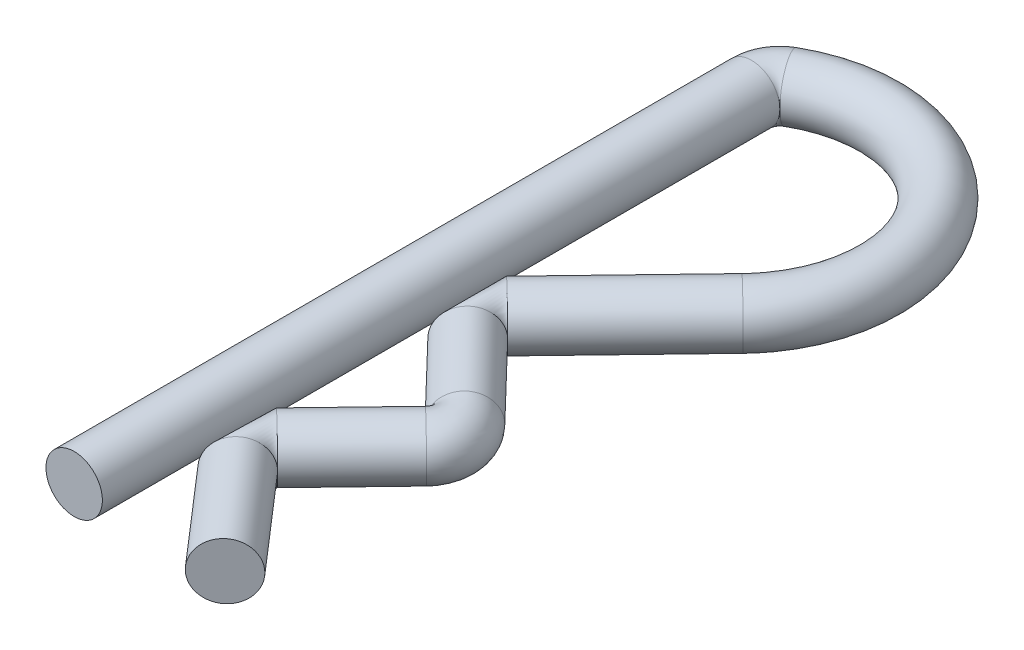
ISO-10303-21;
HEADER;
FILE_DESCRIPTION(('STEP AP214'),'2;1');
FILE_NAME('part.step','',(''),(''),'','','');
FILE_SCHEMA(('AUTOMOTIVE_DESIGN { 1 0 10303 214 1 1 1 1 }'));
ENDSEC;
DATA;
#1=APPLICATION_CONTEXT('core data for automotive mechanical design processes');
#2=APPLICATION_PROTOCOL_DEFINITION('international standard','automotive_design',2000,#1);
#3=PRODUCT_CONTEXT('',#1,'mechanical');
#4=PRODUCT('Part','Part','',(#3));
#5=PRODUCT_RELATED_PRODUCT_CATEGORY('part','',(#4));
#6=PRODUCT_DEFINITION_FORMATION('','',#4);
#7=PRODUCT_DEFINITION_CONTEXT('part definition',#1,'design');
#8=PRODUCT_DEFINITION('design','',#6,#7);
#9=PRODUCT_DEFINITION_SHAPE('','',#8);
#10=(LENGTH_UNIT() NAMED_UNIT(*) SI_UNIT(.MILLI.,.METRE.));
#11=(NAMED_UNIT(*) PLANE_ANGLE_UNIT() SI_UNIT($,.RADIAN.));
#12=(NAMED_UNIT(*) SI_UNIT($,.STERADIAN.) SOLID_ANGLE_UNIT());
#13=UNCERTAINTY_MEASURE_WITH_UNIT(LENGTH_MEASURE(1.E-05),#10,'distance_accuracy_value','');
#14=(GEOMETRIC_REPRESENTATION_CONTEXT(3) GLOBAL_UNCERTAINTY_ASSIGNED_CONTEXT((#13)) GLOBAL_UNIT_ASSIGNED_CONTEXT((#10,
#11,#12)) REPRESENTATION_CONTEXT('',''));
#15=CARTESIAN_POINT('',(0.,0.,0.));
#16=DIRECTION('',(0.,0.,1.));
#17=DIRECTION('',(1.,0.,0.));
#18=AXIS2_PLACEMENT_3D('',#15,#16,#17);
#19=CARTESIAN_POINT('',(0.,0.,0.));
#20=DIRECTION('',(0.,0.,1.));
#21=DIRECTION('',(1.,0.,0.));
#22=AXIS2_PLACEMENT_3D('',#19,#20,#21);
#23=PLANE('',#22);
#24=CARTESIAN_POINT('',(0.,0.,0.));
#25=DIRECTION('',(0.,0.,1.));
#26=DIRECTION('',(1.,0.,0.));
#27=AXIS2_PLACEMENT_3D('',#24,#25,#26);
#28=CIRCLE('',#27,0.5);
#29=CARTESIAN_POINT('',(0.500000000000001,0.,0.));
#30=VERTEX_POINT('',#29);
#31=EDGE_CURVE('E98',#30,#30,#28,.T.);
#32=ORIENTED_EDGE('',*,*,#31,.T.);
#33=EDGE_LOOP('',(#32));
#34=FACE_BOUND('',#33,.T.);
#35=ADVANCED_FACE('F49',(#34),#23,.T.);
#36=CARTESIAN_POINT('',(2.6730641528331,0.,0.));
#37=DIRECTION('',(-0.654662037737364,0.,-0.755921699877416));
#38=DIRECTION('',(-0.755921699877416,0.,0.654662037737364));
#39=AXIS2_PLACEMENT_3D('',#36,#37,#38);
#40=PLANE('',#39);
#41=CARTESIAN_POINT('',(2.6730641528331,0.,0.));
#42=DIRECTION('',(-0.654662037737364,0.,-0.755921699877416));
#43=DIRECTION('',(-0.755921699877416,0.,0.654662037737364));
#44=AXIS2_PLACEMENT_3D('',#41,#42,#43);
#45=CIRCLE('',#44,0.5);
#46=CARTESIAN_POINT('',(2.29510330289439,0.,0.327331018868683));
#47=VERTEX_POINT('',#46);
#48=EDGE_CURVE('E12',#47,#47,#45,.T.);
#49=ORIENTED_EDGE('',*,*,#48,.F.);
#50=EDGE_LOOP('',(#49));
#51=FACE_BOUND('',#50,.T.);
#52=ADVANCED_FACE('F106',(#51),#40,.F.);
#53=CARTESIAN_POINT('',(0.,0.,0.));
#54=DIRECTION('',(0.,0.,-1.));
#55=DIRECTION('',(-1.,0.,0.));
#56=AXIS2_PLACEMENT_3D('',#53,#54,#55);
#57=CYLINDRICAL_SURFACE('',#56,0.5);
#58=CARTESIAN_POINT('',(0.,0.,-12.));
#59=DIRECTION('',(0.,0.,1.));
#60=DIRECTION('',(1.,0.,0.));
#61=AXIS2_PLACEMENT_3D('',#58,#59,#60);
#62=CIRCLE('',#61,0.5);
#63=CARTESIAN_POINT('',(0.5,0.,-12.));
#64=VERTEX_POINT('',#63);
#65=EDGE_CURVE('E62',#64,#64,#62,.T.);
#66=ORIENTED_EDGE('',*,*,#65,.T.);
#67=EDGE_LOOP('',(#66));
#68=FACE_BOUND('',#67,.T.);
#69=ORIENTED_EDGE('',*,*,#31,.F.);
#70=EDGE_LOOP('',(#69));
#71=FACE_BOUND('',#70,.T.);
#72=ADVANCED_FACE('F103',(#68,#71),#57,.T.);
#73=CARTESIAN_POINT('',(0.5,0.,-12.5));
#74=DIRECTION('',(-1.,0.,0.));
#75=DIRECTION('',(0.,0.,-1.));
#76=AXIS2_PLACEMENT_3D('',#73,#74,#75);
#77=CIRCLE('',#76,0.5);
#78=TRIMMED_CURVE('',#77,(PARAMETER_VALUE(-3.14159259036952)),
(PARAMETER_VALUE(3.14159259036952)),.T.,.PARAMETER.);
#79=CARTESIAN_POINT('',(0.5,0.,-12.));
#80=DIRECTION('',(0.,-1.,0.));
#81=AXIS1_PLACEMENT('',#79,#80);
#82=SURFACE_OF_REVOLUTION('',#78,#81);
#83=CARTESIAN_POINT('',(0.25,0.,-12.4330127018922));
#84=DIRECTION('',(-0.866025403784438,0.,0.500000000000002));
#85=DIRECTION('',(0.500000000000002,0.,0.866025403784438));
#86=AXIS2_PLACEMENT_3D('',#83,#84,#85);
#87=CIRCLE('',#86,0.5);
#88=EDGE_CURVE('E95',#64,#64,#87,.T.);
#89=ORIENTED_EDGE('',*,*,#88,.T.);
#90=ORIENTED_EDGE('',*,*,#65,.F.);
#91=EDGE_LOOP('',(#89,#90));
#92=FACE_BOUND('',#91,.T.);
#93=ADVANCED_FACE('F105',(#92),#82,.T.);
#94=CARTESIAN_POINT('',(1.5,0.,-10.2679491924311));
#95=DIRECTION('',(0.,-1.,0.));
#96=DIRECTION('',(0.,0.,-1.));
#97=AXIS2_PLACEMENT_3D('',#94,#95,#96);
#98=TOROIDAL_SURFACE('',#97,2.5,0.5);
#99=CARTESIAN_POINT('',(3.30171718635653,0.,-8.53479738708126));
#100=DIRECTION('',(0.693260722139947,0.,-0.720686874542612));
#101=DIRECTION('',(-0.720686874542612,0.,-0.693260722139947));
#102=AXIS2_PLACEMENT_3D('',#99,#100,#101);
#103=CIRCLE('',#102,0.5);
#104=CARTESIAN_POINT('',(2.94137374908522,0.,-8.88142774815123));
#105=VERTEX_POINT('',#104);
#106=EDGE_CURVE('E92',#105,#105,#103,.T.);
#107=ORIENTED_EDGE('',*,*,#106,.T.);
#108=EDGE_LOOP('',(#107));
#109=FACE_BOUND('',#108,.T.);
#110=ORIENTED_EDGE('',*,*,#88,.F.);
#111=EDGE_LOOP('',(#110));
#112=FACE_BOUND('',#111,.T.);
#113=ADVANCED_FACE('F113',(#109,#112),#98,.T.);
#114=CARTESIAN_POINT('',(3.30171718635653,0.,-8.53479738708125));
#115=DIRECTION('',(-0.693260722139948,0.,0.720686874542611));
#116=DIRECTION('',(0.720686874542611,0.,0.693260722139948));
#117=AXIS2_PLACEMENT_3D('',#114,#115,#116);
#118=CYLINDRICAL_SURFACE('',#117,0.5);
#119=CARTESIAN_POINT('',(1.25650329668252,0.,-6.40867259903542));
#120=DIRECTION('',(0.693260722139948,0.,-0.720686874542611));
#121=DIRECTION('',(-0.720686874542611,0.,-0.693260722139948));
#122=AXIS2_PLACEMENT_3D('',#119,#120,#121);
#123=CIRCLE('',#122,0.5);
#124=CARTESIAN_POINT('',(1.61684673395382,0.,-6.06204223796544));
#125=VERTEX_POINT('',#124);
#126=EDGE_CURVE('E68',#125,#125,#123,.T.);
#127=ORIENTED_EDGE('',*,*,#126,.T.);
#128=EDGE_LOOP('',(#127));
#129=FACE_BOUND('',#128,.T.);
#130=ORIENTED_EDGE('',*,*,#106,.F.);
#131=EDGE_LOOP('',(#130));
#132=FACE_BOUND('',#131,.T.);
#133=ADVANCED_FACE('F140',(#129,#132),#118,.T.);
#134=CARTESIAN_POINT('',(1.61684673395382,0.,-6.06204223796544));
#135=DIRECTION('',(0.,1.,0.));
#136=DIRECTION('',(0.,0.,1.));
#137=AXIS2_PLACEMENT_3D('',#134,#135,#136);
#138=TOROIDAL_SURFACE('',#137,0.500000000000002,0.5);
#139=CARTESIAN_POINT('',(1.25650329668252,0.,-5.71541187689547));
#140=DIRECTION('',(-0.693260722139949,0.,-0.720686874542611));
#141=DIRECTION('',(-0.720686874542611,0.,0.693260722139949));
#142=AXIS2_PLACEMENT_3D('',#139,#140,#141);
#143=CIRCLE('',#142,0.5);
#144=EDGE_CURVE('E89',#125,#125,#143,.T.);
#145=ORIENTED_EDGE('',*,*,#144,.T.);
#146=ORIENTED_EDGE('',*,*,#126,.F.);
#147=EDGE_LOOP('',(#145,#146));
#148=FACE_BOUND('',#147,.T.);
#149=ADVANCED_FACE('F136',(#148),#138,.T.);
#150=CARTESIAN_POINT('',(1.25650329668252,0.,-5.71541187689547));
#151=DIRECTION('',(0.693260722139948,0.,0.720686874542611));
#152=DIRECTION('',(0.720686874542611,0.,-0.693260722139949));
#153=AXIS2_PLACEMENT_3D('',#150,#151,#152);
#154=CYLINDRICAL_SURFACE('',#153,0.5);
#155=CARTESIAN_POINT('',(2.5334075901044,0.,-4.38799185304694));
#156=DIRECTION('',(-0.693260722139948,0.,-0.720686874542611));
#157=DIRECTION('',(-0.720686874542611,0.,0.693260722139949));
#158=AXIS2_PLACEMENT_3D('',#155,#156,#157);
#159=CIRCLE('',#158,0.5);
#160=CARTESIAN_POINT('',(2.1730641528331,0.,-4.04136149197696));
#161=VERTEX_POINT('',#160);
#162=EDGE_CURVE('E84',#161,#161,#159,.T.);
#163=ORIENTED_EDGE('',*,*,#162,.T.);
#164=EDGE_LOOP('',(#163));
#165=FACE_BOUND('',#164,.T.);
#166=ORIENTED_EDGE('',*,*,#144,.F.);
#167=EDGE_LOOP('',(#166));
#168=FACE_BOUND('',#167,.T.);
#169=ADVANCED_FACE('F132',(#165,#168),#154,.T.);
#170=CARTESIAN_POINT('',(2.1730641528331,0.,-4.54136149197696));
#171=DIRECTION('',(-1.,0.,0.));
#172=DIRECTION('',(0.,0.,-1.));
#173=AXIS2_PLACEMENT_3D('',#170,#171,#172);
#174=CIRCLE('',#173,0.5);
#175=TRIMMED_CURVE('',#174,(PARAMETER_VALUE(-3.14159259036952)),
(PARAMETER_VALUE(3.14159259036952)),.T.,.PARAMETER.);
#176=CARTESIAN_POINT('',(2.1730641528331,0.,-4.04136149197696));
#177=DIRECTION('',(0.,-1.,0.));
#178=AXIS1_PLACEMENT('',#176,#177);
#179=SURFACE_OF_REVOLUTION('',#175,#178);
#180=CARTESIAN_POINT('',(2.5334075901044,0.,-3.69473113090699));
#181=DIRECTION('',(0.693260722139949,0.,-0.720686874542611));
#182=DIRECTION('',(-0.720686874542611,0.,-0.693260722139949));
#183=AXIS2_PLACEMENT_3D('',#180,#181,#182);
#184=CIRCLE('',#183,0.5);
#185=EDGE_CURVE('E81',#161,#161,#184,.T.);
#186=ORIENTED_EDGE('',*,*,#185,.T.);
#187=ORIENTED_EDGE('',*,*,#162,.F.);
#188=EDGE_LOOP('',(#186,#187));
#189=FACE_BOUND('',#188,.T.);
#190=ADVANCED_FACE('F129',(#189),#179,.T.);
#191=CARTESIAN_POINT('',(2.5334075901044,0.,-3.69473113090699));
#192=DIRECTION('',(-0.693260722139948,0.,0.720686874542611));
#193=DIRECTION('',(0.720686874542611,0.,0.693260722139948));
#194=AXIS2_PLACEMENT_3D('',#191,#192,#193);
#195=CYLINDRICAL_SURFACE('',#194,0.5);
#196=CARTESIAN_POINT('',(1.2394858241174,0.,-2.34962040466627));
#197=DIRECTION('',(0.693260722139948,0.,-0.720686874542611));
#198=DIRECTION('',(-0.720686874542612,0.,-0.693260722139948));
#199=AXIS2_PLACEMENT_3D('',#196,#197,#198);
#200=CIRCLE('',#199,0.5);
#201=CARTESIAN_POINT('',(1.5998292613887,0.,-2.00299004359629));
#202=VERTEX_POINT('',#201);
#203=EDGE_CURVE('E77',#202,#202,#200,.T.);
#204=ORIENTED_EDGE('',*,*,#203,.T.);
#205=EDGE_LOOP('',(#204));
#206=FACE_BOUND('',#205,.T.);
#207=ORIENTED_EDGE('',*,*,#185,.F.);
#208=EDGE_LOOP('',(#207));
#209=FACE_BOUND('',#208,.T.);
#210=ADVANCED_FACE('F123',(#206,#209),#195,.T.);
#211=CARTESIAN_POINT('',(1.5998292613887,0.,-2.00299004359629));
#212=DIRECTION('',(0.,1.,0.));
#213=DIRECTION('',(0.,0.,1.));
#214=AXIS2_PLACEMENT_3D('',#211,#212,#213);
#215=DEGENERATE_TOROIDAL_SURFACE('',#214,0.5,0.5,.T.);
#216=CARTESIAN_POINT('',(1.22186841144999,0.,-1.67565902472761));
#217=DIRECTION('',(-0.654662037737364,0.,-0.755921699877416));
#218=DIRECTION('',(-0.755921699877416,0.,0.654662037737364));
#219=AXIS2_PLACEMENT_3D('',#216,#217,#218);
#220=CIRCLE('',#219,0.5);
#221=EDGE_CURVE('E56',#202,#202,#220,.T.);
#222=ORIENTED_EDGE('',*,*,#221,.T.);
#223=ORIENTED_EDGE('',*,*,#203,.F.);
#224=EDGE_LOOP('',(#222,#223));
#225=FACE_BOUND('',#224,.T.);
#226=ADVANCED_FACE('F78',(#225),#215,.T.);
#227=CARTESIAN_POINT('',(1.22186841144999,0.,-1.67565902472761));
#228=DIRECTION('',(0.654662037737365,0.,0.755921699877416));
#229=DIRECTION('',(0.755921699877416,0.,-0.654662037737365));
#230=AXIS2_PLACEMENT_3D('',#227,#228,#229);
#231=CYLINDRICAL_SURFACE('',#230,0.5);
#232=ORIENTED_EDGE('',*,*,#48,.T.);
#233=EDGE_LOOP('',(#232));
#234=FACE_BOUND('',#233,.T.);
#235=ORIENTED_EDGE('',*,*,#221,.F.);
#236=EDGE_LOOP('',(#235));
#237=FACE_BOUND('',#236,.T.);
#238=ADVANCED_FACE('F116',(#234,#237),#231,.T.);
#239=CLOSED_SHELL('',(#35,#52,#72,#93,#113,#133,#149,#169,#190,#210,#226,#238));
#240=MANIFOLD_SOLID_BREP('B2',#239);
#241=ADVANCED_BREP_SHAPE_REPRESENTATION('',(#18,#240),#14);
#242=SHAPE_DEFINITION_REPRESENTATION(#9,#241);
ENDSEC;
END-ISO-10303-21;
